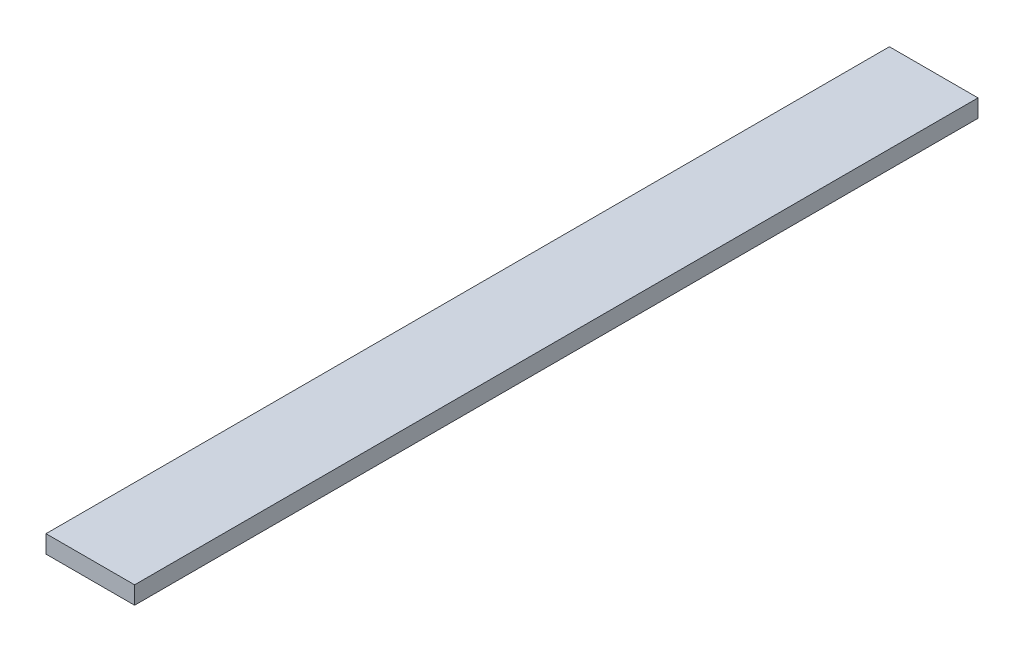
ISO-10303-21;
HEADER;
FILE_DESCRIPTION(('STEP AP214'),'2;1');
FILE_NAME('part.step','',(''),(''),'','','');
FILE_SCHEMA(('AUTOMOTIVE_DESIGN { 1 0 10303 214 1 1 1 1 }'));
ENDSEC;
DATA;
#1=APPLICATION_CONTEXT('core data for automotive mechanical design processes');
#2=APPLICATION_PROTOCOL_DEFINITION('international standard','automotive_design',2000,#1);
#3=PRODUCT_CONTEXT('',#1,'mechanical');
#4=PRODUCT('Part','Part','',(#3));
#5=PRODUCT_RELATED_PRODUCT_CATEGORY('part','',(#4));
#6=PRODUCT_DEFINITION_FORMATION('','',#4);
#7=PRODUCT_DEFINITION_CONTEXT('part definition',#1,'design');
#8=PRODUCT_DEFINITION('design','',#6,#7);
#9=PRODUCT_DEFINITION_SHAPE('','',#8);
#10=(LENGTH_UNIT() NAMED_UNIT(*) SI_UNIT(.MILLI.,.METRE.));
#11=(NAMED_UNIT(*) PLANE_ANGLE_UNIT() SI_UNIT($,.RADIAN.));
#12=(NAMED_UNIT(*) SI_UNIT($,.STERADIAN.) SOLID_ANGLE_UNIT());
#13=UNCERTAINTY_MEASURE_WITH_UNIT(LENGTH_MEASURE(1.E-05),#10,'distance_accuracy_value','');
#14=(GEOMETRIC_REPRESENTATION_CONTEXT(3) GLOBAL_UNCERTAINTY_ASSIGNED_CONTEXT((#13)) GLOBAL_UNIT_ASSIGNED_CONTEXT((#10,
#11,#12)) REPRESENTATION_CONTEXT('',''));
#15=CARTESIAN_POINT('',(0.,0.,0.));
#16=DIRECTION('',(0.,0.,1.));
#17=DIRECTION('',(1.,0.,0.));
#18=AXIS2_PLACEMENT_3D('',#15,#16,#17);
#19=CARTESIAN_POINT('',(0.,1.42999999999,0.));
#20=DIRECTION('',(0.,-1.,0.));
#21=DIRECTION('',(1.,0.,0.));
#22=AXIS2_PLACEMENT_3D('',#19,#20,#21);
#23=PLANE('',#22);
#24=DIRECTION('',(1.,0.,0.));
#25=VECTOR('',#24,1.);
#26=CARTESIAN_POINT('',(0.,1.42999999999,2.575));
#27=LINE('',#26,#25);
#28=CARTESIAN_POINT('',(-1.125,1.42999999999,2.575));
#29=VERTEX_POINT('',#28);
#30=CARTESIAN_POINT('',(-1.375,1.42999999999,2.575));
#31=VERTEX_POINT('',#30);
#32=EDGE_CURVE('E19',#29,#31,#27,.F.);
#33=ORIENTED_EDGE('',*,*,#32,.F.);
#34=DIRECTION('',(0.,0.,1.));
#35=VECTOR('',#34,1.);
#36=CARTESIAN_POINT('',(-1.125,1.42999999999,0.195));
#37=LINE('',#36,#35);
#38=CARTESIAN_POINT('',(-1.125,1.42999999999,0.195));
#39=VERTEX_POINT('',#38);
#40=EDGE_CURVE('E68',#29,#39,#37,.F.);
#41=ORIENTED_EDGE('',*,*,#40,.T.);
#42=DIRECTION('',(1.,0.,0.));
#43=VECTOR('',#42,1.);
#44=CARTESIAN_POINT('',(-1.375,1.42999999999,0.195));
#45=LINE('',#44,#43);
#46=CARTESIAN_POINT('',(-1.375,1.42999999999,0.195));
#47=VERTEX_POINT('',#46);
#48=EDGE_CURVE('E55',#39,#47,#45,.F.);
#49=ORIENTED_EDGE('',*,*,#48,.T.);
#50=DIRECTION('',(0.,0.,1.));
#51=VECTOR('',#50,1.);
#52=CARTESIAN_POINT('',(-1.375,1.42999999999,0.195));
#53=LINE('',#52,#51);
#54=EDGE_CURVE('E61',#47,#31,#53,.T.);
#55=ORIENTED_EDGE('',*,*,#54,.T.);
#56=EDGE_LOOP('',(#33,#41,#49,#55));
#57=FACE_BOUND('',#56,.T.);
#58=ADVANCED_FACE('F16',(#57),#23,.F.);
#59=CARTESIAN_POINT('',(-1.375,1.37999999999,0.195));
#60=DIRECTION('',(1.,0.,0.));
#61=DIRECTION('',(0.,1.,0.));
#62=AXIS2_PLACEMENT_3D('',#59,#60,#61);
#63=PLANE('',#62);
#64=DIRECTION('',(0.,1.,0.));
#65=VECTOR('',#64,1.);
#66=CARTESIAN_POINT('',(-1.375,1.37999999999,0.195));
#67=LINE('',#66,#65);
#68=CARTESIAN_POINT('',(-1.375,1.37999999999,0.195));
#69=VERTEX_POINT('',#68);
#70=EDGE_CURVE('E63',#47,#69,#67,.F.);
#71=ORIENTED_EDGE('',*,*,#70,.T.);
#72=DIRECTION('',(0.,0.,1.));
#73=VECTOR('',#72,1.);
#74=CARTESIAN_POINT('',(-1.375,1.37999999999,0.));
#75=LINE('',#74,#73);
#76=CARTESIAN_POINT('',(-1.375,1.37999999999,2.575));
#77=VERTEX_POINT('',#76);
#78=EDGE_CURVE('E82',#77,#69,#75,.F.);
#79=ORIENTED_EDGE('',*,*,#78,.F.);
#80=DIRECTION('',(0.,1.,0.));
#81=VECTOR('',#80,1.);
#82=CARTESIAN_POINT('',(-1.375,1.37999999999,2.575));
#83=LINE('',#82,#81);
#84=EDGE_CURVE('E66',#77,#31,#83,.T.);
#85=ORIENTED_EDGE('',*,*,#84,.T.);
#86=ORIENTED_EDGE('',*,*,#54,.F.);
#87=EDGE_LOOP('',(#71,#79,#85,#86));
#88=FACE_BOUND('',#87,.T.);
#89=ADVANCED_FACE('F62',(#88),#63,.F.);
#90=CARTESIAN_POINT('',(-1.375,1.37999999999,0.195));
#91=DIRECTION('',(0.,0.,1.));
#92=DIRECTION('',(1.,0.,0.));
#93=AXIS2_PLACEMENT_3D('',#90,#91,#92);
#94=PLANE('',#93);
#95=DIRECTION('',(0.,-1.,0.));
#96=VECTOR('',#95,1.);
#97=CARTESIAN_POINT('',(-1.125,1.37999999999,0.195));
#98=LINE('',#97,#96);
#99=CARTESIAN_POINT('',(-1.125,1.37999999999,0.195));
#100=VERTEX_POINT('',#99);
#101=EDGE_CURVE('E70',#39,#100,#98,.T.);
#102=ORIENTED_EDGE('',*,*,#101,.T.);
#103=DIRECTION('',(1.,0.,0.));
#104=VECTOR('',#103,1.);
#105=CARTESIAN_POINT('',(0.,1.37999999999,0.195));
#106=LINE('',#105,#104);
#107=EDGE_CURVE('E74',#69,#100,#106,.T.);
#108=ORIENTED_EDGE('',*,*,#107,.F.);
#109=ORIENTED_EDGE('',*,*,#70,.F.);
#110=ORIENTED_EDGE('',*,*,#48,.F.);
#111=EDGE_LOOP('',(#102,#108,#109,#110));
#112=FACE_BOUND('',#111,.T.);
#113=ADVANCED_FACE('F72',(#112),#94,.F.);
#114=CARTESIAN_POINT('',(-1.125,1.37999999999,0.195));
#115=DIRECTION('',(-1.,0.,0.));
#116=DIRECTION('',(0.,-1.,0.));
#117=AXIS2_PLACEMENT_3D('',#114,#115,#116);
#118=PLANE('',#117);
#119=DIRECTION('',(0.,1.,0.));
#120=VECTOR('',#119,1.);
#121=CARTESIAN_POINT('',(-1.125,1.37999999999,2.575));
#122=LINE('',#121,#120);
#123=CARTESIAN_POINT('',(-1.125,1.37999999999,2.575));
#124=VERTEX_POINT('',#123);
#125=EDGE_CURVE('E34',#29,#124,#122,.F.);
#126=ORIENTED_EDGE('',*,*,#125,.T.);
#127=DIRECTION('',(0.,0.,1.));
#128=VECTOR('',#127,1.);
#129=CARTESIAN_POINT('',(-1.125,1.37999999999,0.));
#130=LINE('',#129,#128);
#131=EDGE_CURVE('E25',#100,#124,#130,.T.);
#132=ORIENTED_EDGE('',*,*,#131,.F.);
#133=ORIENTED_EDGE('',*,*,#101,.F.);
#134=ORIENTED_EDGE('',*,*,#40,.F.);
#135=EDGE_LOOP('',(#126,#132,#133,#134));
#136=FACE_BOUND('',#135,.T.);
#137=ADVANCED_FACE('F88',(#136),#118,.F.);
#138=CARTESIAN_POINT('',(-1.375,1.37999999999,2.575));
#139=DIRECTION('',(0.,0.,-1.));
#140=DIRECTION('',(-1.,0.,0.));
#141=AXIS2_PLACEMENT_3D('',#138,#139,#140);
#142=PLANE('',#141);
#143=ORIENTED_EDGE('',*,*,#84,.F.);
#144=DIRECTION('',(1.,0.,0.));
#145=VECTOR('',#144,1.);
#146=CARTESIAN_POINT('',(0.,1.37999999999,2.575));
#147=LINE('',#146,#145);
#148=EDGE_CURVE('E11',#124,#77,#147,.F.);
#149=ORIENTED_EDGE('',*,*,#148,.F.);
#150=ORIENTED_EDGE('',*,*,#125,.F.);
#151=ORIENTED_EDGE('',*,*,#32,.T.);
#152=EDGE_LOOP('',(#143,#149,#150,#151));
#153=FACE_BOUND('',#152,.T.);
#154=ADVANCED_FACE('F90',(#153),#142,.F.);
#155=CARTESIAN_POINT('',(0.,1.37999999999,0.));
#156=DIRECTION('',(0.,-1.,0.));
#157=DIRECTION('',(1.,0.,0.));
#158=AXIS2_PLACEMENT_3D('',#155,#156,#157);
#159=PLANE('',#158);
#160=ORIENTED_EDGE('',*,*,#131,.T.);
#161=ORIENTED_EDGE('',*,*,#148,.T.);
#162=ORIENTED_EDGE('',*,*,#78,.T.);
#163=ORIENTED_EDGE('',*,*,#107,.T.);
#164=EDGE_LOOP('',(#160,#161,#162,#163));
#165=FACE_BOUND('',#164,.T.);
#166=ADVANCED_FACE('F87',(#165),#159,.T.);
#167=CLOSED_SHELL('',(#58,#89,#113,#137,#154,#166));
#168=MANIFOLD_SOLID_BREP('B1',#167);
#169=ADVANCED_BREP_SHAPE_REPRESENTATION('',(#18,#168),#14);
#170=SHAPE_DEFINITION_REPRESENTATION(#9,#169);
ENDSEC;
END-ISO-10303-21;
